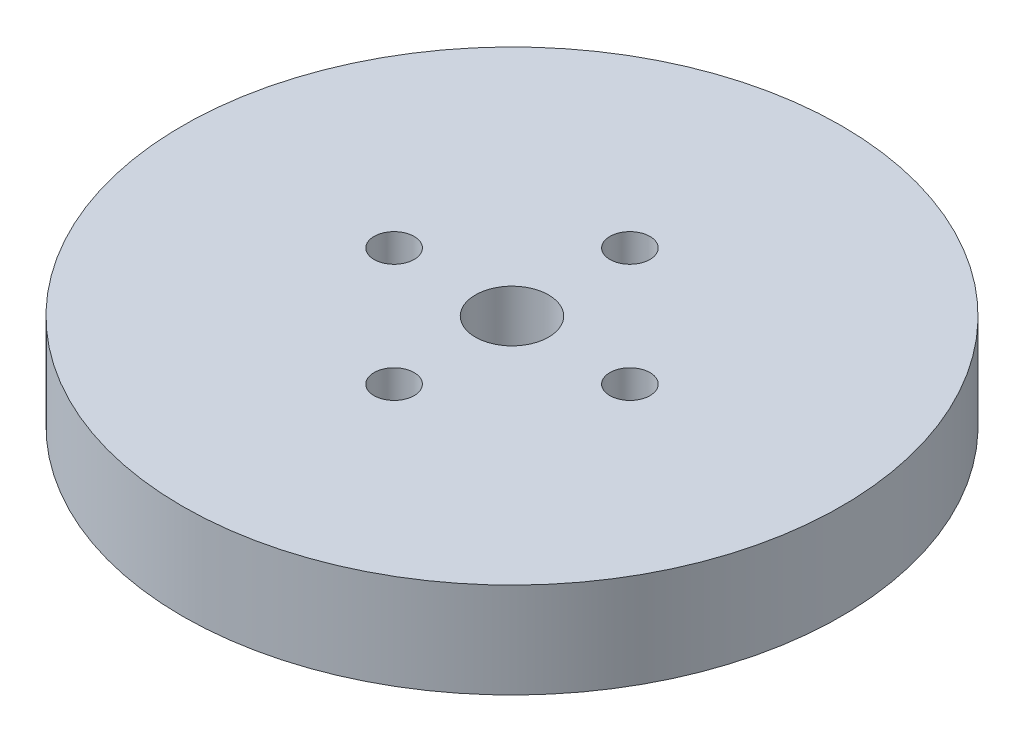
ISO-10303-21;
HEADER;
FILE_DESCRIPTION(('STEP AP214'),'2;1');
FILE_NAME('part.step','',(''),(''),'','','');
FILE_SCHEMA(('AUTOMOTIVE_DESIGN { 1 0 10303 214 1 1 1 1 }'));
ENDSEC;
DATA;
#1=APPLICATION_CONTEXT('core data for automotive mechanical design processes');
#2=APPLICATION_PROTOCOL_DEFINITION('international standard','automotive_design',2000,#1);
#3=PRODUCT_CONTEXT('',#1,'mechanical');
#4=PRODUCT('Part','Part','',(#3));
#5=PRODUCT_RELATED_PRODUCT_CATEGORY('part','',(#4));
#6=PRODUCT_DEFINITION_FORMATION('','',#4);
#7=PRODUCT_DEFINITION_CONTEXT('part definition',#1,'design');
#8=PRODUCT_DEFINITION('design','',#6,#7);
#9=PRODUCT_DEFINITION_SHAPE('','',#8);
#10=(LENGTH_UNIT() NAMED_UNIT(*) SI_UNIT(.MILLI.,.METRE.));
#11=(NAMED_UNIT(*) PLANE_ANGLE_UNIT() SI_UNIT($,.RADIAN.));
#12=(NAMED_UNIT(*) SI_UNIT($,.STERADIAN.) SOLID_ANGLE_UNIT());
#13=UNCERTAINTY_MEASURE_WITH_UNIT(LENGTH_MEASURE(1.E-05),#10,'distance_accuracy_value','');
#14=(GEOMETRIC_REPRESENTATION_CONTEXT(3) GLOBAL_UNCERTAINTY_ASSIGNED_CONTEXT((#13)) GLOBAL_UNIT_ASSIGNED_CONTEXT((#10,
#11,#12)) REPRESENTATION_CONTEXT('',''));
#15=CARTESIAN_POINT('',(0.,0.,0.));
#16=DIRECTION('',(0.,0.,1.));
#17=DIRECTION('',(1.,0.,0.));
#18=AXIS2_PLACEMENT_3D('',#15,#16,#17);
#19=CARTESIAN_POINT('',(0.,26.,0.));
#20=DIRECTION('',(0.,-1.,0.));
#21=DIRECTION('',(0.,0.,-1.));
#22=AXIS2_PLACEMENT_3D('',#19,#20,#21);
#23=CYLINDRICAL_SURFACE('',#22,90.);
#24=CARTESIAN_POINT('',(0.,26.,0.));
#25=DIRECTION('',(0.,1.,0.));
#26=DIRECTION('',(0.,0.,1.));
#27=AXIS2_PLACEMENT_3D('',#24,#25,#26);
#28=CIRCLE('',#27,90.);
#29=CARTESIAN_POINT('',(0.,26.,-90.));
#30=VERTEX_POINT('',#29);
#31=EDGE_CURVE('E10',#30,#30,#28,.T.);
#32=CARTESIAN_POINT('',(0.,0.,0.));
#33=DIRECTION('',(0.,1.,0.));
#34=DIRECTION('',(0.,0.,1.));
#35=AXIS2_PLACEMENT_3D('',#32,#33,#34);
#36=CIRCLE('',#35,90.);
#37=CARTESIAN_POINT('',(0.,0.,-90.));
#38=VERTEX_POINT('',#37);
#39=EDGE_CURVE('E37',#38,#38,#36,.T.);
#40=CARTESIAN_POINT('',(0.,26.,-90.));
#41=CARTESIAN_POINT('',(0.,25.7291666666667,-90.));
#42=CARTESIAN_POINT('',(0.,25.4583333333333,-90.));
#43=CARTESIAN_POINT('',(0.,24.9166666666667,-90.));
#44=CARTESIAN_POINT('',(0.,24.6458333333333,-90.));
#45=CARTESIAN_POINT('',(0.,24.1041666666667,-90.));
#46=CARTESIAN_POINT('',(0.,23.8333333333333,-90.));
#47=CARTESIAN_POINT('',(0.,23.2916666666667,-90.));
#48=CARTESIAN_POINT('',(0.,23.0208333333333,-90.));
#49=CARTESIAN_POINT('',(0.,22.4791666666667,-90.));
#50=CARTESIAN_POINT('',(0.,22.2083333333333,-90.));
#51=CARTESIAN_POINT('',(0.,21.6666666666667,-90.));
#52=CARTESIAN_POINT('',(0.,21.3958333333333,-90.));
#53=CARTESIAN_POINT('',(0.,20.8541666666667,-90.));
#54=CARTESIAN_POINT('',(0.,20.5833333333333,-90.));
#55=CARTESIAN_POINT('',(0.,20.0416666666667,-90.));
#56=CARTESIAN_POINT('',(0.,19.7708333333333,-90.));
#57=CARTESIAN_POINT('',(0.,19.2291666666667,-90.));
#58=CARTESIAN_POINT('',(0.,18.9583333333333,-90.));
#59=CARTESIAN_POINT('',(0.,18.4166666666667,-90.));
#60=CARTESIAN_POINT('',(0.,18.1458333333333,-90.));
#61=CARTESIAN_POINT('',(0.,17.6041666666667,-90.));
#62=CARTESIAN_POINT('',(0.,17.3333333333333,-90.));
#63=CARTESIAN_POINT('',(0.,16.7916666666667,-90.));
#64=CARTESIAN_POINT('',(0.,16.5208333333333,-90.));
#65=CARTESIAN_POINT('',(0.,15.9791666666667,-90.));
#66=CARTESIAN_POINT('',(0.,15.7083333333333,-90.));
#67=CARTESIAN_POINT('',(0.,15.1666666666667,-90.));
#68=CARTESIAN_POINT('',(0.,14.8958333333333,-90.));
#69=CARTESIAN_POINT('',(0.,14.3541666666667,-90.));
#70=CARTESIAN_POINT('',(0.,14.0833333333333,-90.));
#71=CARTESIAN_POINT('',(0.,13.5416666666667,-90.));
#72=CARTESIAN_POINT('',(0.,13.2708333333333,-90.));
#73=CARTESIAN_POINT('',(0.,12.7291666666667,-90.));
#74=CARTESIAN_POINT('',(0.,12.4583333333333,-90.));
#75=CARTESIAN_POINT('',(0.,11.9166666666667,-90.));
#76=CARTESIAN_POINT('',(0.,11.6458333333333,-90.));
#77=CARTESIAN_POINT('',(0.,11.1041666666667,-90.));
#78=CARTESIAN_POINT('',(0.,10.8333333333333,-90.));
#79=CARTESIAN_POINT('',(0.,10.2916666666667,-90.));
#80=CARTESIAN_POINT('',(0.,10.0208333333333,-90.));
#81=CARTESIAN_POINT('',(0.,9.47916666666667,-90.));
#82=CARTESIAN_POINT('',(0.,9.20833333333333,-90.));
#83=CARTESIAN_POINT('',(0.,8.66666666666667,-90.));
#84=CARTESIAN_POINT('',(0.,8.39583333333333,-90.));
#85=CARTESIAN_POINT('',(0.,7.85416666666667,-90.));
#86=CARTESIAN_POINT('',(0.,7.58333333333333,-90.));
#87=CARTESIAN_POINT('',(0.,7.04166666666667,-90.));
#88=CARTESIAN_POINT('',(0.,6.77083333333333,-90.));
#89=CARTESIAN_POINT('',(0.,6.22916666666667,-90.));
#90=CARTESIAN_POINT('',(0.,5.95833333333333,-90.));
#91=CARTESIAN_POINT('',(0.,5.41666666666667,-90.));
#92=CARTESIAN_POINT('',(0.,5.14583333333333,-90.));
#93=CARTESIAN_POINT('',(0.,4.60416666666667,-90.));
#94=CARTESIAN_POINT('',(0.,4.33333333333333,-90.));
#95=CARTESIAN_POINT('',(0.,3.79166666666667,-90.));
#96=CARTESIAN_POINT('',(0.,3.52083333333333,-90.));
#97=CARTESIAN_POINT('',(0.,2.97916666666667,-90.));
#98=CARTESIAN_POINT('',(0.,2.70833333333333,-90.));
#99=CARTESIAN_POINT('',(0.,2.16666666666667,-90.));
#100=CARTESIAN_POINT('',(0.,1.89583333333333,-90.));
#101=CARTESIAN_POINT('',(0.,1.35416666666667,-90.));
#102=CARTESIAN_POINT('',(0.,1.08333333333333,-90.));
#103=CARTESIAN_POINT('',(0.,0.541666666666667,-90.));
#104=CARTESIAN_POINT('',(0.,0.270833333333334,-90.));
#105=CARTESIAN_POINT('',(0.,0.,-90.));
#106=B_SPLINE_CURVE_WITH_KNOTS('',3,(#40,#41,#42,#43,#44,#45,#46,#47,#48,#49,#50,#51,#52,#53,
#54,#55,#56,#57,#58,#59,#60,#61,#62,#63,#64,#65,#66,#67,#68,#69,#70,#71,#72,#73,#74,#75,#76,#77,
#78,#79,#80,#81,#82,#83,#84,#85,#86,#87,#88,#89,#90,#91,#92,#93,#94,#95,#96,#97,#98,#99,#100,
#101,#102,#103,#104,#105),.UNSPECIFIED.,.F.,.F.,(4,2,2,2,2,2,2,2,2,2,2,2,2,2,2,2,2,2,2,2,2,2,2,
2,2,2,2,2,2,2,2,2,4),(0.,0.812500000000001,1.625,2.4375,3.25,4.0625,4.875,5.6875,6.5,7.3125,
8.125,8.9375,9.75,10.5625,11.375,12.1875,13.,13.8125,14.625,15.4375,16.25,17.0625,17.875,
18.6875,19.5,20.3125,21.125,21.9375,22.75,23.5625,24.375,25.1875,26.),.UNSPECIFIED.);
#107=EDGE_CURVE('BSEAM40',#30,#38,#106,.T.);
#108=ORIENTED_EDGE('',*,*,#31,.F.);
#109=ORIENTED_EDGE('',*,*,#39,.T.);
#110=ORIENTED_EDGE('',*,*,#107,.T.);
#111=ORIENTED_EDGE('',*,*,#107,.F.);
#112=EDGE_LOOP('',(#108,#110,#109,#111));
#113=FACE_BOUND('',#112,.T.);
#114=ADVANCED_FACE('F40',(#113),#23,.T.);
#115=CARTESIAN_POINT('',(0.,26.,0.));
#116=DIRECTION('',(0.,1.,0.));
#117=DIRECTION('',(0.,0.,1.));
#118=AXIS2_PLACEMENT_3D('',#115,#116,#117);
#119=PLANE('',#118);
#120=CARTESIAN_POINT('',(1.1243020852477E-13,26.,32.2012915475077));
#121=DIRECTION('',(0.,1.,0.));
#122=DIRECTION('',(1.,0.,0.));
#123=AXIS2_PLACEMENT_3D('',#120,#121,#122);
#124=CIRCLE('',#123,5.47080332805873);
#125=CARTESIAN_POINT('',(5.47080332805884,26.,32.2012915475077));
#126=VERTEX_POINT('',#125);
#127=EDGE_CURVE('E71',#126,#126,#124,.T.);
#128=ORIENTED_EDGE('',*,*,#127,.F.);
#129=EDGE_LOOP('',(#128));
#130=FACE_BOUND('',#129,.T.);
#131=CARTESIAN_POINT('',(32.2012915475077,26.,0.));
#132=DIRECTION('',(0.,1.,0.));
#133=DIRECTION('',(0.,0.,-1.));
#134=AXIS2_PLACEMENT_3D('',#131,#132,#133);
#135=CIRCLE('',#134,5.47080332805873);
#136=CARTESIAN_POINT('',(32.2012915475077,26.,-5.47080332805873));
#137=VERTEX_POINT('',#136);
#138=EDGE_CURVE('E70',#137,#137,#135,.T.);
#139=ORIENTED_EDGE('',*,*,#138,.F.);
#140=EDGE_LOOP('',(#139));
#141=FACE_BOUND('',#140,.T.);
#142=CARTESIAN_POINT('',(-3.37290625574311E-13,26.,-32.2012915475077));
#143=DIRECTION('',(0.,1.,0.));
#144=DIRECTION('',(-1.,0.,0.));
#145=AXIS2_PLACEMENT_3D('',#142,#143,#144);
#146=CIRCLE('',#145,5.47080332805873);
#147=CARTESIAN_POINT('',(-5.47080332805907,26.,-32.2012915475076));
#148=VERTEX_POINT('',#147);
#149=EDGE_CURVE('E61',#148,#148,#146,.T.);
#150=ORIENTED_EDGE('',*,*,#149,.F.);
#151=EDGE_LOOP('',(#150));
#152=FACE_BOUND('',#151,.T.);
#153=CARTESIAN_POINT('',(-32.2012915475077,26.,0.));
#154=DIRECTION('',(0.,1.,0.));
#155=DIRECTION('',(0.,0.,1.));
#156=AXIS2_PLACEMENT_3D('',#153,#154,#155);
#157=CIRCLE('',#156,5.47080332805873);
#158=CARTESIAN_POINT('',(-32.2012915475077,26.,5.47080332805873));
#159=VERTEX_POINT('',#158);
#160=EDGE_CURVE('E54',#159,#159,#157,.T.);
#161=ORIENTED_EDGE('',*,*,#160,.F.);
#162=EDGE_LOOP('',(#161));
#163=FACE_BOUND('',#162,.T.);
#164=CARTESIAN_POINT('',(0.,26.,0.));
#165=DIRECTION('',(0.,1.,0.));
#166=DIRECTION('',(0.,0.,1.));
#167=AXIS2_PLACEMENT_3D('',#164,#165,#166);
#168=CIRCLE('',#167,10.);
#169=CARTESIAN_POINT('',(0.,26.,-10.));
#170=VERTEX_POINT('',#169);
#171=EDGE_CURVE('E50',#170,#170,#168,.T.);
#172=ORIENTED_EDGE('',*,*,#171,.F.);
#173=EDGE_LOOP('',(#172));
#174=FACE_BOUND('',#173,.T.);
#175=ORIENTED_EDGE('',*,*,#31,.T.);
#176=EDGE_LOOP('',(#175));
#177=FACE_BOUND('',#176,.T.);
#178=ADVANCED_FACE('F86',(#130,#141,#152,#163,#174,#177),#119,.T.);
#179=CARTESIAN_POINT('',(0.,0.,0.));
#180=DIRECTION('',(0.,1.,0.));
#181=DIRECTION('',(0.,0.,1.));
#182=AXIS2_PLACEMENT_3D('',#179,#180,#181);
#183=PLANE('',#182);
#184=CARTESIAN_POINT('',(0.,0.,0.));
#185=DIRECTION('',(0.,1.,0.));
#186=DIRECTION('',(0.,0.,1.));
#187=AXIS2_PLACEMENT_3D('',#184,#185,#186);
#188=CIRCLE('',#187,10.);
#189=CARTESIAN_POINT('',(0.,0.,-10.));
#190=VERTEX_POINT('',#189);
#191=EDGE_CURVE('E47',#190,#190,#188,.T.);
#192=ORIENTED_EDGE('',*,*,#191,.T.);
#193=EDGE_LOOP('',(#192));
#194=FACE_BOUND('',#193,.T.);
#195=ORIENTED_EDGE('',*,*,#39,.F.);
#196=EDGE_LOOP('',(#195));
#197=FACE_BOUND('',#196,.T.);
#198=ADVANCED_FACE('F93',(#194,#197),#183,.F.);
#199=CARTESIAN_POINT('',(0.,26.,0.));
#200=DIRECTION('',(0.,-1.,0.));
#201=DIRECTION('',(0.,0.,-1.));
#202=AXIS2_PLACEMENT_3D('',#199,#200,#201);
#203=CYLINDRICAL_SURFACE('',#202,10.);
#204=CARTESIAN_POINT('',(0.,26.,-10.));
#205=CARTESIAN_POINT('',(0.,25.7291666666667,-10.));
#206=CARTESIAN_POINT('',(0.,25.4583333333333,-10.));
#207=CARTESIAN_POINT('',(0.,24.9166666666667,-10.));
#208=CARTESIAN_POINT('',(0.,24.6458333333333,-10.));
#209=CARTESIAN_POINT('',(0.,24.1041666666667,-10.));
#210=CARTESIAN_POINT('',(0.,23.8333333333333,-10.));
#211=CARTESIAN_POINT('',(0.,23.2916666666667,-10.));
#212=CARTESIAN_POINT('',(0.,23.0208333333333,-10.));
#213=CARTESIAN_POINT('',(0.,22.4791666666667,-10.));
#214=CARTESIAN_POINT('',(0.,22.2083333333333,-10.));
#215=CARTESIAN_POINT('',(0.,21.6666666666667,-10.));
#216=CARTESIAN_POINT('',(0.,21.3958333333333,-10.));
#217=CARTESIAN_POINT('',(0.,20.8541666666667,-10.));
#218=CARTESIAN_POINT('',(0.,20.5833333333333,-10.));
#219=CARTESIAN_POINT('',(0.,20.0416666666667,-10.));
#220=CARTESIAN_POINT('',(0.,19.7708333333333,-10.));
#221=CARTESIAN_POINT('',(0.,19.2291666666667,-10.));
#222=CARTESIAN_POINT('',(0.,18.9583333333333,-10.));
#223=CARTESIAN_POINT('',(0.,18.4166666666667,-10.));
#224=CARTESIAN_POINT('',(0.,18.1458333333333,-10.));
#225=CARTESIAN_POINT('',(0.,17.6041666666667,-10.));
#226=CARTESIAN_POINT('',(0.,17.3333333333333,-10.));
#227=CARTESIAN_POINT('',(0.,16.7916666666667,-10.));
#228=CARTESIAN_POINT('',(0.,16.5208333333333,-10.));
#229=CARTESIAN_POINT('',(0.,15.9791666666667,-10.));
#230=CARTESIAN_POINT('',(0.,15.7083333333333,-10.));
#231=CARTESIAN_POINT('',(0.,15.1666666666667,-10.));
#232=CARTESIAN_POINT('',(0.,14.8958333333333,-10.));
#233=CARTESIAN_POINT('',(0.,14.3541666666667,-10.));
#234=CARTESIAN_POINT('',(0.,14.0833333333333,-10.));
#235=CARTESIAN_POINT('',(0.,13.5416666666667,-10.));
#236=CARTESIAN_POINT('',(0.,13.2708333333333,-10.));
#237=CARTESIAN_POINT('',(0.,12.7291666666667,-10.));
#238=CARTESIAN_POINT('',(0.,12.4583333333333,-10.));
#239=CARTESIAN_POINT('',(0.,11.9166666666667,-10.));
#240=CARTESIAN_POINT('',(0.,11.6458333333333,-10.));
#241=CARTESIAN_POINT('',(0.,11.1041666666667,-10.));
#242=CARTESIAN_POINT('',(0.,10.8333333333333,-10.));
#243=CARTESIAN_POINT('',(0.,10.2916666666667,-10.));
#244=CARTESIAN_POINT('',(0.,10.0208333333333,-10.));
#245=CARTESIAN_POINT('',(0.,9.47916666666667,-10.));
#246=CARTESIAN_POINT('',(0.,9.20833333333333,-10.));
#247=CARTESIAN_POINT('',(0.,8.66666666666667,-10.));
#248=CARTESIAN_POINT('',(0.,8.39583333333333,-10.));
#249=CARTESIAN_POINT('',(0.,7.85416666666667,-10.));
#250=CARTESIAN_POINT('',(0.,7.58333333333333,-10.));
#251=CARTESIAN_POINT('',(0.,7.04166666666667,-10.));
#252=CARTESIAN_POINT('',(0.,6.77083333333333,-10.));
#253=CARTESIAN_POINT('',(0.,6.22916666666667,-10.));
#254=CARTESIAN_POINT('',(0.,5.95833333333333,-10.));
#255=CARTESIAN_POINT('',(0.,5.41666666666667,-10.));
#256=CARTESIAN_POINT('',(0.,5.14583333333333,-10.));
#257=CARTESIAN_POINT('',(0.,4.60416666666667,-10.));
#258=CARTESIAN_POINT('',(0.,4.33333333333333,-10.));
#259=CARTESIAN_POINT('',(0.,3.79166666666667,-10.));
#260=CARTESIAN_POINT('',(0.,3.52083333333333,-10.));
#261=CARTESIAN_POINT('',(0.,2.97916666666667,-10.));
#262=CARTESIAN_POINT('',(0.,2.70833333333333,-10.));
#263=CARTESIAN_POINT('',(0.,2.16666666666667,-10.));
#264=CARTESIAN_POINT('',(0.,1.89583333333333,-10.));
#265=CARTESIAN_POINT('',(0.,1.35416666666667,-10.));
#266=CARTESIAN_POINT('',(0.,1.08333333333333,-10.));
#267=CARTESIAN_POINT('',(0.,0.541666666666667,-10.));
#268=CARTESIAN_POINT('',(0.,0.270833333333334,-10.));
#269=CARTESIAN_POINT('',(0.,0.,-10.));
#270=B_SPLINE_CURVE_WITH_KNOTS('',3,(#204,#205,#206,#207,#208,#209,#210,#211,#212,#213,#214,
#215,#216,#217,#218,#219,#220,#221,#222,#223,#224,#225,#226,#227,#228,#229,#230,#231,#232,#233,
#234,#235,#236,#237,#238,#239,#240,#241,#242,#243,#244,#245,#246,#247,#248,#249,#250,#251,#252,
#253,#254,#255,#256,#257,#258,#259,#260,#261,#262,#263,#264,#265,#266,#267,#268,#269),
.UNSPECIFIED.,.F.,.F.,(4,2,2,2,2,2,2,2,2,2,2,2,2,2,2,2,2,2,2,2,2,2,2,2,2,2,2,2,2,2,2,2,4),(0.,
0.812499999999997,1.625,2.4375,3.25,4.0625,4.875,5.6875,6.5,7.3125,8.125,8.93749999999999,
9.74999999999999,10.5625,11.375,12.1875,13.,13.8125,14.625,15.4375,16.25,17.0625,17.875,18.6875,
19.5,20.3125,21.125,21.9375,22.75,23.5625,24.375,25.1875,26.),.UNSPECIFIED.);
#271=EDGE_CURVE('BSEAM101',#170,#190,#270,.T.);
#272=ORIENTED_EDGE('',*,*,#171,.T.);
#273=ORIENTED_EDGE('',*,*,#191,.F.);
#274=ORIENTED_EDGE('',*,*,#271,.T.);
#275=ORIENTED_EDGE('',*,*,#271,.F.);
#276=EDGE_LOOP('',(#272,#274,#273,#275));
#277=FACE_BOUND('',#276,.T.);
#278=ADVANCED_FACE('F101',(#277),#203,.F.);
#279=CARTESIAN_POINT('',(-32.2012915475077,6.84311668154116,0.));
#280=DIRECTION('',(0.,1.,0.));
#281=DIRECTION('',(0.,0.,1.));
#282=AXIS2_PLACEMENT_3D('',#279,#280,#281);
#283=CYLINDRICAL_SURFACE('',#282,5.47080332805873);
#284=CARTESIAN_POINT('',(-32.2012915475077,6.84311668154116,0.));
#285=DIRECTION('',(0.,1.,0.));
#286=DIRECTION('',(0.,0.,1.));
#287=AXIS2_PLACEMENT_3D('',#284,#285,#286);
#288=CIRCLE('',#287,5.47080332805873);
#289=CARTESIAN_POINT('',(-32.2012915475077,6.84311668154116,5.47080332805873));
#290=VERTEX_POINT('',#289);
#291=EDGE_CURVE('E55',#290,#290,#288,.T.);
#292=ORIENTED_EDGE('',*,*,#291,.F.);
#293=EDGE_LOOP('',(#292));
#294=FACE_BOUND('',#293,.T.);
#295=ORIENTED_EDGE('',*,*,#160,.T.);
#296=EDGE_LOOP('',(#295));
#297=FACE_BOUND('',#296,.T.);
#298=ADVANCED_FACE('F102',(#294,#297),#283,.F.);
#299=CARTESIAN_POINT('',(-32.2012915475077,6.84311668154116,0.));
#300=DIRECTION('',(0.,1.,0.));
#301=DIRECTION('',(0.,0.,1.));
#302=AXIS2_PLACEMENT_3D('',#299,#300,#301);
#303=PLANE('',#302);
#304=ORIENTED_EDGE('',*,*,#291,.T.);
#305=EDGE_LOOP('',(#304));
#306=FACE_BOUND('',#305,.T.);
#307=ADVANCED_FACE('F133',(#306),#303,.T.);
#308=CARTESIAN_POINT('',(-3.37290625574311E-13,6.84311668154116,-32.2012915475077));
#309=DIRECTION('',(0.,1.,0.));
#310=DIRECTION('',(0.,0.,1.));
#311=AXIS2_PLACEMENT_3D('',#308,#309,#310);
#312=CYLINDRICAL_SURFACE('',#311,5.47080332805873);
#313=CARTESIAN_POINT('',(-3.37290625574311E-13,6.84311668154116,-32.2012915475077));
#314=DIRECTION('',(0.,1.,0.));
#315=DIRECTION('',(-1.,0.,0.));
#316=AXIS2_PLACEMENT_3D('',#313,#314,#315);
#317=CIRCLE('',#316,5.47080332805873);
#318=CARTESIAN_POINT('',(-5.47080332805907,6.84311668154116,-32.2012915475076));
#319=VERTEX_POINT('',#318);
#320=EDGE_CURVE('E63',#319,#319,#317,.T.);
#321=ORIENTED_EDGE('',*,*,#320,.F.);
#322=EDGE_LOOP('',(#321));
#323=FACE_BOUND('',#322,.T.);
#324=ORIENTED_EDGE('',*,*,#149,.T.);
#325=EDGE_LOOP('',(#324));
#326=FACE_BOUND('',#325,.T.);
#327=ADVANCED_FACE('F142',(#323,#326),#312,.F.);
#328=CARTESIAN_POINT('',(-3.37290625574311E-13,6.84311668154116,-32.2012915475077));
#329=DIRECTION('',(0.,1.,0.));
#330=DIRECTION('',(-1.,0.,0.));
#331=AXIS2_PLACEMENT_3D('',#328,#329,#330);
#332=PLANE('',#331);
#333=ORIENTED_EDGE('',*,*,#320,.T.);
#334=EDGE_LOOP('',(#333));
#335=FACE_BOUND('',#334,.T.);
#336=ADVANCED_FACE('F156',(#335),#332,.T.);
#337=CARTESIAN_POINT('',(32.2012915475077,6.84311668154116,0.));
#338=DIRECTION('',(0.,1.,0.));
#339=DIRECTION('',(0.,0.,1.));
#340=AXIS2_PLACEMENT_3D('',#337,#338,#339);
#341=CYLINDRICAL_SURFACE('',#340,5.47080332805873);
#342=CARTESIAN_POINT('',(32.2012915475077,6.84311668154116,0.));
#343=DIRECTION('',(0.,1.,0.));
#344=DIRECTION('',(0.,0.,-1.));
#345=AXIS2_PLACEMENT_3D('',#342,#343,#344);
#346=CIRCLE('',#345,5.47080332805873);
#347=CARTESIAN_POINT('',(32.2012915475077,6.84311668154116,-5.47080332805873));
#348=VERTEX_POINT('',#347);
#349=EDGE_CURVE('E69',#348,#348,#346,.T.);
#350=ORIENTED_EDGE('',*,*,#349,.F.);
#351=EDGE_LOOP('',(#350));
#352=FACE_BOUND('',#351,.T.);
#353=ORIENTED_EDGE('',*,*,#138,.T.);
#354=EDGE_LOOP('',(#353));
#355=FACE_BOUND('',#354,.T.);
#356=ADVANCED_FACE('F164',(#352,#355),#341,.F.);
#357=CARTESIAN_POINT('',(32.2012915475077,6.84311668154116,0.));
#358=DIRECTION('',(0.,1.,0.));
#359=DIRECTION('',(0.,0.,-1.));
#360=AXIS2_PLACEMENT_3D('',#357,#358,#359);
#361=PLANE('',#360);
#362=ORIENTED_EDGE('',*,*,#349,.T.);
#363=EDGE_LOOP('',(#362));
#364=FACE_BOUND('',#363,.T.);
#365=ADVANCED_FACE('F83',(#364),#361,.T.);
#366=CARTESIAN_POINT('',(1.1243020852477E-13,6.84311668154116,32.2012915475077));
#367=DIRECTION('',(0.,1.,0.));
#368=DIRECTION('',(0.,0.,1.));
#369=AXIS2_PLACEMENT_3D('',#366,#367,#368);
#370=CYLINDRICAL_SURFACE('',#369,5.47080332805873);
#371=CARTESIAN_POINT('',(1.1243020852477E-13,6.84311668154116,32.2012915475077));
#372=DIRECTION('',(0.,1.,0.));
#373=DIRECTION('',(1.,0.,0.));
#374=AXIS2_PLACEMENT_3D('',#371,#372,#373);
#375=CIRCLE('',#374,5.47080332805873);
#376=CARTESIAN_POINT('',(5.47080332805884,6.84311668154116,32.2012915475077));
#377=VERTEX_POINT('',#376);
#378=EDGE_CURVE('E59',#377,#377,#375,.T.);
#379=ORIENTED_EDGE('',*,*,#378,.F.);
#380=EDGE_LOOP('',(#379));
#381=FACE_BOUND('',#380,.T.);
#382=ORIENTED_EDGE('',*,*,#127,.T.);
#383=EDGE_LOOP('',(#382));
#384=FACE_BOUND('',#383,.T.);
#385=ADVANCED_FACE('F81',(#381,#384),#370,.F.);
#386=CARTESIAN_POINT('',(1.1243020852477E-13,6.84311668154116,32.2012915475077));
#387=DIRECTION('',(0.,1.,0.));
#388=DIRECTION('',(1.,0.,0.));
#389=AXIS2_PLACEMENT_3D('',#386,#387,#388);
#390=PLANE('',#389);
#391=ORIENTED_EDGE('',*,*,#378,.T.);
#392=EDGE_LOOP('',(#391));
#393=FACE_BOUND('',#392,.T.);
#394=ADVANCED_FACE('F78',(#393),#390,.T.);
#395=CLOSED_SHELL('',(#114,#178,#198,#278,#298,#307,#327,#336,#356,#365,#385,#394));
#396=MANIFOLD_SOLID_BREP('B2',#395);
#397=ADVANCED_BREP_SHAPE_REPRESENTATION('',(#18,#396),#14);
#398=SHAPE_DEFINITION_REPRESENTATION(#9,#397);
ENDSEC;
END-ISO-10303-21;
